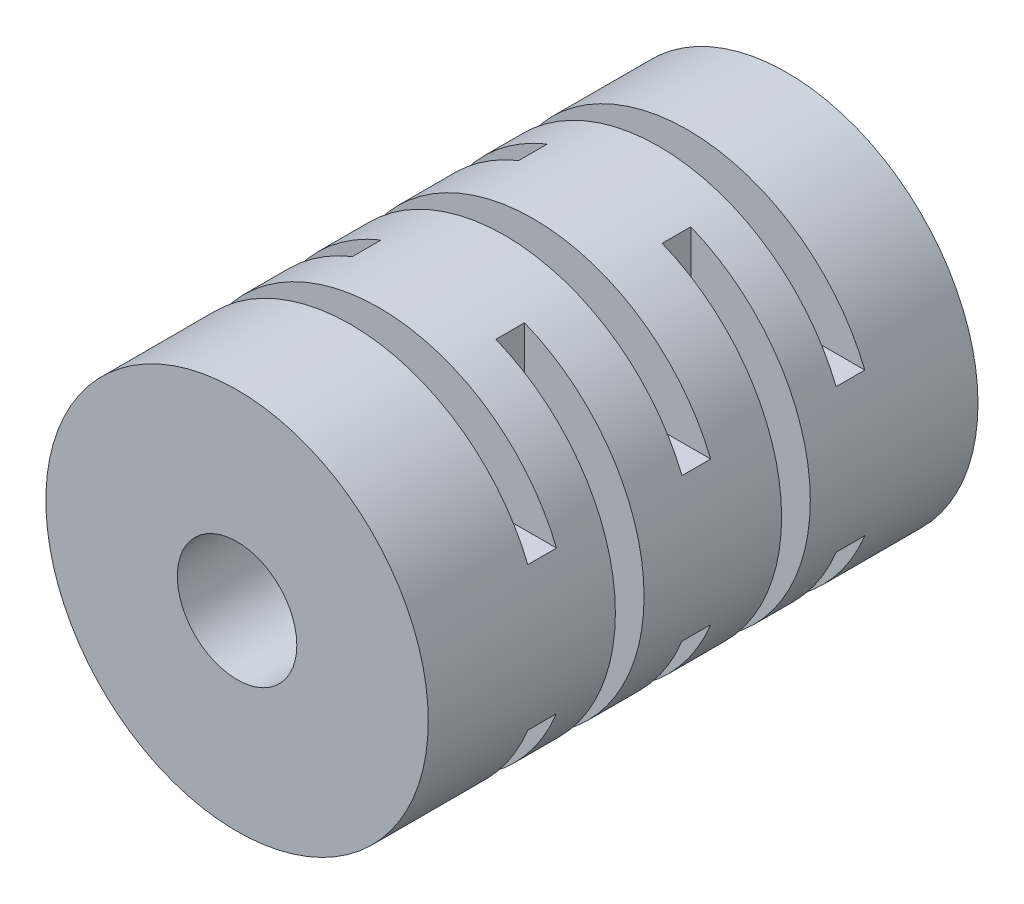
ISO-10303-21;
HEADER;
FILE_DESCRIPTION(('STEP AP214'),'2;1');
FILE_NAME('part.step','',(''),(''),'','','');
FILE_SCHEMA(('AUTOMOTIVE_DESIGN { 1 0 10303 214 1 1 1 1 }'));
ENDSEC;
DATA;
#1=APPLICATION_CONTEXT('core data for automotive mechanical design processes');
#2=APPLICATION_PROTOCOL_DEFINITION('international standard','automotive_design',2000,#1);
#3=PRODUCT_CONTEXT('',#1,'mechanical');
#4=PRODUCT('Part','Part','',(#3));
#5=PRODUCT_RELATED_PRODUCT_CATEGORY('part','',(#4));
#6=PRODUCT_DEFINITION_FORMATION('','',#4);
#7=PRODUCT_DEFINITION_CONTEXT('part definition',#1,'design');
#8=PRODUCT_DEFINITION('design','',#6,#7);
#9=PRODUCT_DEFINITION_SHAPE('','',#8);
#10=(LENGTH_UNIT() NAMED_UNIT(*) SI_UNIT(.MILLI.,.METRE.));
#11=(NAMED_UNIT(*) PLANE_ANGLE_UNIT() SI_UNIT($,.RADIAN.));
#12=(NAMED_UNIT(*) SI_UNIT($,.STERADIAN.) SOLID_ANGLE_UNIT());
#13=UNCERTAINTY_MEASURE_WITH_UNIT(LENGTH_MEASURE(1.E-05),#10,'distance_accuracy_value','');
#14=(GEOMETRIC_REPRESENTATION_CONTEXT(3) GLOBAL_UNCERTAINTY_ASSIGNED_CONTEXT((#13)) GLOBAL_UNIT_ASSIGNED_CONTEXT((#10,
#11,#12)) REPRESENTATION_CONTEXT('',''));
#15=CARTESIAN_POINT('',(0.,0.,0.));
#16=DIRECTION('',(0.,0.,1.));
#17=DIRECTION('',(1.,0.,0.));
#18=AXIS2_PLACEMENT_3D('',#15,#16,#17);
#19=CARTESIAN_POINT('',(0.,0.,23.));
#20=DIRECTION('',(0.,0.,1.));
#21=DIRECTION('',(1.,0.,0.));
#22=AXIS2_PLACEMENT_3D('',#19,#20,#21);
#23=PLANE('',#22);
#24=CARTESIAN_POINT('',(0.,0.,23.));
#25=DIRECTION('',(0.,0.,1.));
#26=DIRECTION('',(1.,0.,0.));
#27=AXIS2_PLACEMENT_3D('',#24,#25,#26);
#28=CIRCLE('',#27,8.);
#29=CARTESIAN_POINT('',(8.,0.,23.));
#30=VERTEX_POINT('',#29);
#31=EDGE_CURVE('E292',#30,#30,#28,.T.);
#32=ORIENTED_EDGE('',*,*,#31,.T.);
#33=EDGE_LOOP('',(#32));
#34=FACE_BOUND('',#33,.T.);
#35=CARTESIAN_POINT('',(0.,0.,23.));
#36=DIRECTION('',(0.,0.,1.));
#37=DIRECTION('',(1.,0.,0.));
#38=AXIS2_PLACEMENT_3D('',#35,#36,#37);
#39=CIRCLE('',#38,2.5);
#40=CARTESIAN_POINT('',(2.5,0.,23.));
#41=VERTEX_POINT('',#40);
#42=EDGE_CURVE('E296',#41,#41,#39,.T.);
#43=ORIENTED_EDGE('',*,*,#42,.F.);
#44=EDGE_LOOP('',(#43));
#45=FACE_BOUND('',#44,.T.);
#46=ADVANCED_FACE('F32',(#34,#45),#23,.T.);
#47=CARTESIAN_POINT('',(0.,0.,0.));
#48=DIRECTION('',(0.,0.,1.));
#49=DIRECTION('',(1.,0.,0.));
#50=AXIS2_PLACEMENT_3D('',#47,#48,#49);
#51=PLANE('',#50);
#52=CARTESIAN_POINT('',(0.,0.,0.));
#53=DIRECTION('',(0.,0.,1.));
#54=DIRECTION('',(1.,0.,0.));
#55=AXIS2_PLACEMENT_3D('',#52,#53,#54);
#56=CIRCLE('',#55,8.);
#57=CARTESIAN_POINT('',(8.,0.,0.));
#58=VERTEX_POINT('',#57);
#59=EDGE_CURVE('E293',#58,#58,#56,.T.);
#60=ORIENTED_EDGE('',*,*,#59,.F.);
#61=EDGE_LOOP('',(#60));
#62=FACE_BOUND('',#61,.T.);
#63=CARTESIAN_POINT('',(0.,0.,0.));
#64=DIRECTION('',(0.,0.,1.));
#65=DIRECTION('',(1.,0.,0.));
#66=AXIS2_PLACEMENT_3D('',#63,#64,#65);
#67=CIRCLE('',#66,2.5);
#68=CARTESIAN_POINT('',(2.5,0.,0.));
#69=VERTEX_POINT('',#68);
#70=EDGE_CURVE('E299',#69,#69,#67,.T.);
#71=ORIENTED_EDGE('',*,*,#70,.T.);
#72=EDGE_LOOP('',(#71));
#73=FACE_BOUND('',#72,.T.);
#74=ADVANCED_FACE('F373',(#62,#73),#51,.F.);
#75=CARTESIAN_POINT('',(0.,0.,23.));
#76=DIRECTION('',(0.,0.,-1.));
#77=DIRECTION('',(-1.,0.,0.));
#78=AXIS2_PLACEMENT_3D('',#75,#76,#77);
#79=CYLINDRICAL_SURFACE('',#78,8.);
#80=CARTESIAN_POINT('',(0.,0.,5.35124700606681));
#81=DIRECTION('',(0.,0.,1.));
#82=DIRECTION('',(0.,-1.,0.));
#83=AXIS2_PLACEMENT_3D('',#80,#81,#82);
#84=CIRCLE('',#83,8.);
#85=CARTESIAN_POINT('',(-7.41619848709566,-3.,5.35124700606682));
#86=VERTEX_POINT('',#85);
#87=CARTESIAN_POINT('',(7.41619848709566,-3.,5.35124700606682));
#88=VERTEX_POINT('',#87);
#89=EDGE_CURVE('E40',#86,#88,#84,.T.);
#90=ORIENTED_EDGE('',*,*,#89,.T.);
#91=DIRECTION('',(0.,0.,-1.));
#92=VECTOR('',#91,1.);
#93=CARTESIAN_POINT('',(7.41619848709566,-3.,23.));
#94=LINE('',#93,#92);
#95=CARTESIAN_POINT('',(7.41619848709566,-3.,4.15124700606682));
#96=VERTEX_POINT('',#95);
#97=EDGE_CURVE('E11',#88,#96,#94,.T.);
#98=ORIENTED_EDGE('',*,*,#97,.T.);
#99=CARTESIAN_POINT('',(0.,0.,4.15124700606681));
#100=DIRECTION('',(0.,0.,-1.));
#101=DIRECTION('',(0.,1.,0.));
#102=AXIS2_PLACEMENT_3D('',#99,#100,#101);
#103=CIRCLE('',#102,8.);
#104=CARTESIAN_POINT('',(-7.41619848709566,-3.,4.15124700606682));
#105=VERTEX_POINT('',#104);
#106=EDGE_CURVE('E169',#96,#105,#103,.T.);
#107=ORIENTED_EDGE('',*,*,#106,.T.);
#108=DIRECTION('',(0.,0.,-1.));
#109=VECTOR('',#108,1.);
#110=CARTESIAN_POINT('',(-7.41619848709566,-3.,23.));
#111=LINE('',#110,#109);
#112=EDGE_CURVE('E175',#105,#86,#111,.F.);
#113=ORIENTED_EDGE('',*,*,#112,.T.);
#114=EDGE_LOOP('',(#90,#98,#107,#113));
#115=FACE_BOUND('',#114,.T.);
#116=CARTESIAN_POINT('',(0.,0.,18.2510441796467));
#117=DIRECTION('',(0.,0.,1.));
#118=DIRECTION('',(1.,0.,0.));
#119=AXIS2_PLACEMENT_3D('',#116,#117,#118);
#120=CIRCLE('',#119,8.);
#121=CARTESIAN_POINT('',(-7.41619848709566,-3.,18.2510441796467));
#122=VERTEX_POINT('',#121);
#123=CARTESIAN_POINT('',(7.41619848709566,-3.,18.2510441796467));
#124=VERTEX_POINT('',#123);
#125=EDGE_CURVE('E187',#122,#124,#120,.T.);
#126=ORIENTED_EDGE('',*,*,#125,.T.);
#127=DIRECTION('',(0.,0.,-1.));
#128=VECTOR('',#127,1.);
#129=CARTESIAN_POINT('',(7.41619848709566,-3.,23.));
#130=LINE('',#129,#128);
#131=CARTESIAN_POINT('',(7.41619848709566,-3.,17.0510441796467));
#132=VERTEX_POINT('',#131);
#133=EDGE_CURVE('E184',#124,#132,#130,.T.);
#134=ORIENTED_EDGE('',*,*,#133,.T.);
#135=CARTESIAN_POINT('',(0.,0.,17.0510441796467));
#136=DIRECTION('',(0.,0.,-1.));
#137=DIRECTION('',(-1.,0.,0.));
#138=AXIS2_PLACEMENT_3D('',#135,#136,#137);
#139=CIRCLE('',#138,8.);
#140=CARTESIAN_POINT('',(-7.41619848709566,-3.,17.0510441796467));
#141=VERTEX_POINT('',#140);
#142=EDGE_CURVE('E190',#132,#141,#139,.T.);
#143=ORIENTED_EDGE('',*,*,#142,.T.);
#144=DIRECTION('',(0.,0.,-1.));
#145=VECTOR('',#144,1.);
#146=CARTESIAN_POINT('',(-7.41619848709566,-3.,23.));
#147=LINE('',#146,#145);
#148=EDGE_CURVE('E193',#141,#122,#147,.F.);
#149=ORIENTED_EDGE('',*,*,#148,.T.);
#150=EDGE_LOOP('',(#126,#134,#143,#149));
#151=FACE_BOUND('',#150,.T.);
#152=CARTESIAN_POINT('',(0.,0.,11.8011455928567));
#153=DIRECTION('',(0.,0.,1.));
#154=DIRECTION('',(0.,-1.,0.));
#155=AXIS2_PLACEMENT_3D('',#152,#153,#154);
#156=CIRCLE('',#155,8.);
#157=CARTESIAN_POINT('',(-7.41619848709566,-3.,11.8011455928567));
#158=VERTEX_POINT('',#157);
#159=CARTESIAN_POINT('',(7.41619848709566,-3.,11.8011455928567));
#160=VERTEX_POINT('',#159);
#161=EDGE_CURVE('E199',#158,#160,#156,.T.);
#162=ORIENTED_EDGE('',*,*,#161,.T.);
#163=DIRECTION('',(0.,0.,-1.));
#164=VECTOR('',#163,1.);
#165=CARTESIAN_POINT('',(7.41619848709566,-3.,23.));
#166=LINE('',#165,#164);
#167=CARTESIAN_POINT('',(7.41619848709566,-3.,10.6011455928567));
#168=VERTEX_POINT('',#167);
#169=EDGE_CURVE('E196',#160,#168,#166,.T.);
#170=ORIENTED_EDGE('',*,*,#169,.T.);
#171=CARTESIAN_POINT('',(0.,0.,10.6011455928567));
#172=DIRECTION('',(0.,0.,-1.));
#173=DIRECTION('',(0.,1.,0.));
#174=AXIS2_PLACEMENT_3D('',#171,#172,#173);
#175=CIRCLE('',#174,8.);
#176=CARTESIAN_POINT('',(-7.41619848709566,-3.,10.6011455928567));
#177=VERTEX_POINT('',#176);
#178=EDGE_CURVE('E202',#168,#177,#175,.T.);
#179=ORIENTED_EDGE('',*,*,#178,.T.);
#180=DIRECTION('',(0.,0.,-1.));
#181=VECTOR('',#180,1.);
#182=CARTESIAN_POINT('',(-7.41619848709566,-3.,23.));
#183=LINE('',#182,#181);
#184=EDGE_CURVE('E205',#177,#158,#183,.F.);
#185=ORIENTED_EDGE('',*,*,#184,.T.);
#186=EDGE_LOOP('',(#162,#170,#179,#185));
#187=FACE_BOUND('',#186,.T.);
#188=CARTESIAN_POINT('',(0.,0.,5.35124700606681));
#189=DIRECTION('',(0.,0.,1.));
#190=DIRECTION('',(0.,-1.,0.));
#191=AXIS2_PLACEMENT_3D('',#188,#189,#190);
#192=CIRCLE('',#191,8.);
#193=CARTESIAN_POINT('',(7.41619848709566,3.,5.35124700606682));
#194=VERTEX_POINT('',#193);
#195=CARTESIAN_POINT('',(-7.41619848709566,3.,5.35124700606682));
#196=VERTEX_POINT('',#195);
#197=EDGE_CURVE('E211',#194,#196,#192,.T.);
#198=ORIENTED_EDGE('',*,*,#197,.T.);
#199=DIRECTION('',(0.,0.,-1.));
#200=VECTOR('',#199,1.);
#201=CARTESIAN_POINT('',(-7.41619848709566,3.,23.));
#202=LINE('',#201,#200);
#203=CARTESIAN_POINT('',(-7.41619848709566,3.,4.15124700606682));
#204=VERTEX_POINT('',#203);
#205=EDGE_CURVE('E208',#196,#204,#202,.T.);
#206=ORIENTED_EDGE('',*,*,#205,.T.);
#207=CARTESIAN_POINT('',(0.,0.,4.15124700606681));
#208=DIRECTION('',(0.,0.,-1.));
#209=DIRECTION('',(0.,1.,0.));
#210=AXIS2_PLACEMENT_3D('',#207,#208,#209);
#211=CIRCLE('',#210,8.);
#212=CARTESIAN_POINT('',(7.41619848709566,3.,4.15124700606682));
#213=VERTEX_POINT('',#212);
#214=EDGE_CURVE('E214',#204,#213,#211,.T.);
#215=ORIENTED_EDGE('',*,*,#214,.T.);
#216=DIRECTION('',(0.,0.,-1.));
#217=VECTOR('',#216,1.);
#218=CARTESIAN_POINT('',(7.41619848709566,3.,23.));
#219=LINE('',#218,#217);
#220=EDGE_CURVE('E217',#213,#194,#219,.F.);
#221=ORIENTED_EDGE('',*,*,#220,.T.);
#222=EDGE_LOOP('',(#198,#206,#215,#221));
#223=FACE_BOUND('',#222,.T.);
#224=CARTESIAN_POINT('',(0.,0.,18.2510441796467));
#225=DIRECTION('',(0.,0.,1.));
#226=DIRECTION('',(1.,0.,0.));
#227=AXIS2_PLACEMENT_3D('',#224,#225,#226);
#228=CIRCLE('',#227,8.);
#229=CARTESIAN_POINT('',(7.41619848709566,3.,18.2510441796467));
#230=VERTEX_POINT('',#229);
#231=CARTESIAN_POINT('',(-7.41619848709566,3.,18.2510441796467));
#232=VERTEX_POINT('',#231);
#233=EDGE_CURVE('E223',#230,#232,#228,.T.);
#234=ORIENTED_EDGE('',*,*,#233,.T.);
#235=DIRECTION('',(0.,0.,-1.));
#236=VECTOR('',#235,1.);
#237=CARTESIAN_POINT('',(-7.41619848709566,3.,23.));
#238=LINE('',#237,#236);
#239=CARTESIAN_POINT('',(-7.41619848709566,3.,17.0510441796467));
#240=VERTEX_POINT('',#239);
#241=EDGE_CURVE('E220',#232,#240,#238,.T.);
#242=ORIENTED_EDGE('',*,*,#241,.T.);
#243=CARTESIAN_POINT('',(0.,0.,17.0510441796467));
#244=DIRECTION('',(0.,0.,-1.));
#245=DIRECTION('',(-1.,0.,0.));
#246=AXIS2_PLACEMENT_3D('',#243,#244,#245);
#247=CIRCLE('',#246,8.);
#248=CARTESIAN_POINT('',(7.41619848709566,3.,17.0510441796467));
#249=VERTEX_POINT('',#248);
#250=EDGE_CURVE('E226',#240,#249,#247,.T.);
#251=ORIENTED_EDGE('',*,*,#250,.T.);
#252=DIRECTION('',(0.,0.,-1.));
#253=VECTOR('',#252,1.);
#254=CARTESIAN_POINT('',(7.41619848709566,3.,23.));
#255=LINE('',#254,#253);
#256=EDGE_CURVE('E229',#249,#230,#255,.F.);
#257=ORIENTED_EDGE('',*,*,#256,.T.);
#258=EDGE_LOOP('',(#234,#242,#251,#257));
#259=FACE_BOUND('',#258,.T.);
#260=CARTESIAN_POINT('',(0.,0.,11.8011455928567));
#261=DIRECTION('',(0.,0.,1.));
#262=DIRECTION('',(0.,-1.,0.));
#263=AXIS2_PLACEMENT_3D('',#260,#261,#262);
#264=CIRCLE('',#263,8.);
#265=CARTESIAN_POINT('',(7.41619848709566,3.,11.8011455928567));
#266=VERTEX_POINT('',#265);
#267=CARTESIAN_POINT('',(-7.41619848709566,3.,11.8011455928567));
#268=VERTEX_POINT('',#267);
#269=EDGE_CURVE('E235',#266,#268,#264,.T.);
#270=ORIENTED_EDGE('',*,*,#269,.T.);
#271=DIRECTION('',(0.,0.,-1.));
#272=VECTOR('',#271,1.);
#273=CARTESIAN_POINT('',(-7.41619848709566,3.,23.));
#274=LINE('',#273,#272);
#275=CARTESIAN_POINT('',(-7.41619848709566,3.,10.6011455928567));
#276=VERTEX_POINT('',#275);
#277=EDGE_CURVE('E232',#268,#276,#274,.T.);
#278=ORIENTED_EDGE('',*,*,#277,.T.);
#279=CARTESIAN_POINT('',(0.,0.,10.6011455928567));
#280=DIRECTION('',(0.,0.,-1.));
#281=DIRECTION('',(0.,1.,0.));
#282=AXIS2_PLACEMENT_3D('',#279,#280,#281);
#283=CIRCLE('',#282,8.);
#284=CARTESIAN_POINT('',(7.41619848709566,3.,10.6011455928567));
#285=VERTEX_POINT('',#284);
#286=EDGE_CURVE('E238',#276,#285,#283,.T.);
#287=ORIENTED_EDGE('',*,*,#286,.T.);
#288=DIRECTION('',(0.,0.,-1.));
#289=VECTOR('',#288,1.);
#290=CARTESIAN_POINT('',(7.41619848709566,3.,23.));
#291=LINE('',#290,#289);
#292=EDGE_CURVE('E241',#285,#266,#291,.F.);
#293=ORIENTED_EDGE('',*,*,#292,.T.);
#294=EDGE_LOOP('',(#270,#278,#287,#293));
#295=FACE_BOUND('',#294,.T.);
#296=DIRECTION('',(0.,0.,-1.));
#297=VECTOR('',#296,1.);
#298=CARTESIAN_POINT('',(2.99999999999999,7.41619848709566,23.));
#299=LINE('',#298,#297);
#300=CARTESIAN_POINT('',(3.,7.41619848709566,15.1712151670788));
#301=VERTEX_POINT('',#300);
#302=CARTESIAN_POINT('',(3.,7.41619848709566,13.9712151670788));
#303=VERTEX_POINT('',#302);
#304=EDGE_CURVE('E247',#301,#303,#299,.T.);
#305=ORIENTED_EDGE('',*,*,#304,.T.);
#306=CARTESIAN_POINT('',(0.,0.,13.9712151670788));
#307=DIRECTION('',(0.,0.,-1.));
#308=DIRECTION('',(-1.,0.,0.));
#309=AXIS2_PLACEMENT_3D('',#306,#307,#308);
#310=CIRCLE('',#309,8.);
#311=CARTESIAN_POINT('',(3.,-7.41619848709566,13.9712151670788));
#312=VERTEX_POINT('',#311);
#313=EDGE_CURVE('E244',#303,#312,#310,.T.);
#314=ORIENTED_EDGE('',*,*,#313,.T.);
#315=DIRECTION('',(0.,0.,-1.));
#316=VECTOR('',#315,1.);
#317=CARTESIAN_POINT('',(2.99999999999999,-7.41619848709566,23.));
#318=LINE('',#317,#316);
#319=CARTESIAN_POINT('',(3.,-7.41619848709566,15.1712151670788));
#320=VERTEX_POINT('',#319);
#321=EDGE_CURVE('E250',#312,#320,#318,.F.);
#322=ORIENTED_EDGE('',*,*,#321,.T.);
#323=CARTESIAN_POINT('',(0.,0.,15.1712151670788));
#324=DIRECTION('',(0.,0.,1.));
#325=DIRECTION('',(1.,0.,0.));
#326=AXIS2_PLACEMENT_3D('',#323,#324,#325);
#327=CIRCLE('',#326,8.);
#328=EDGE_CURVE('E253',#320,#301,#327,.T.);
#329=ORIENTED_EDGE('',*,*,#328,.T.);
#330=EDGE_LOOP('',(#305,#314,#322,#329));
#331=FACE_BOUND('',#330,.T.);
#332=DIRECTION('',(0.,0.,-1.));
#333=VECTOR('',#332,1.);
#334=CARTESIAN_POINT('',(3.,7.41619848709566,23.));
#335=LINE('',#334,#333);
#336=CARTESIAN_POINT('',(3.,7.41619848709566,8.21672267382401));
#337=VERTEX_POINT('',#336);
#338=CARTESIAN_POINT('',(3.,7.41619848709566,7.01672267382401));
#339=VERTEX_POINT('',#338);
#340=EDGE_CURVE('E259',#337,#339,#335,.T.);
#341=ORIENTED_EDGE('',*,*,#340,.T.);
#342=CARTESIAN_POINT('',(0.,0.,7.01672267382401));
#343=DIRECTION('',(0.,0.,-1.));
#344=DIRECTION('',(-1.,0.,0.));
#345=AXIS2_PLACEMENT_3D('',#342,#343,#344);
#346=CIRCLE('',#345,8.);
#347=CARTESIAN_POINT('',(3.,-7.41619848709566,7.01672267382401));
#348=VERTEX_POINT('',#347);
#349=EDGE_CURVE('E256',#339,#348,#346,.T.);
#350=ORIENTED_EDGE('',*,*,#349,.T.);
#351=DIRECTION('',(0.,0.,-1.));
#352=VECTOR('',#351,1.);
#353=CARTESIAN_POINT('',(3.,-7.41619848709566,23.));
#354=LINE('',#353,#352);
#355=CARTESIAN_POINT('',(3.,-7.41619848709566,8.21672267382401));
#356=VERTEX_POINT('',#355);
#357=EDGE_CURVE('E262',#348,#356,#354,.F.);
#358=ORIENTED_EDGE('',*,*,#357,.T.);
#359=CARTESIAN_POINT('',(0.,0.,8.21672267382401));
#360=DIRECTION('',(0.,0.,1.));
#361=DIRECTION('',(1.,0.,0.));
#362=AXIS2_PLACEMENT_3D('',#359,#360,#361);
#363=CIRCLE('',#362,8.);
#364=EDGE_CURVE('E265',#356,#337,#363,.T.);
#365=ORIENTED_EDGE('',*,*,#364,.T.);
#366=EDGE_LOOP('',(#341,#350,#358,#365));
#367=FACE_BOUND('',#366,.T.);
#368=DIRECTION('',(0.,0.,-1.));
#369=VECTOR('',#368,1.);
#370=CARTESIAN_POINT('',(-2.99999999999999,-7.41619848709566,23.));
#371=LINE('',#370,#369);
#372=CARTESIAN_POINT('',(-3.,-7.41619848709566,15.1712151670788));
#373=VERTEX_POINT('',#372);
#374=CARTESIAN_POINT('',(-3.,-7.41619848709566,13.9712151670788));
#375=VERTEX_POINT('',#374);
#376=EDGE_CURVE('E271',#373,#375,#371,.T.);
#377=ORIENTED_EDGE('',*,*,#376,.T.);
#378=CARTESIAN_POINT('',(0.,0.,13.9712151670788));
#379=DIRECTION('',(0.,0.,-1.));
#380=DIRECTION('',(-1.,0.,0.));
#381=AXIS2_PLACEMENT_3D('',#378,#379,#380);
#382=CIRCLE('',#381,8.);
#383=CARTESIAN_POINT('',(-3.,7.41619848709566,13.9712151670788));
#384=VERTEX_POINT('',#383);
#385=EDGE_CURVE('E268',#375,#384,#382,.T.);
#386=ORIENTED_EDGE('',*,*,#385,.T.);
#387=DIRECTION('',(0.,0.,-1.));
#388=VECTOR('',#387,1.);
#389=CARTESIAN_POINT('',(-2.99999999999999,7.41619848709566,23.));
#390=LINE('',#389,#388);
#391=CARTESIAN_POINT('',(-3.,7.41619848709566,15.1712151670788));
#392=VERTEX_POINT('',#391);
#393=EDGE_CURVE('E274',#384,#392,#390,.F.);
#394=ORIENTED_EDGE('',*,*,#393,.T.);
#395=CARTESIAN_POINT('',(0.,0.,15.1712151670788));
#396=DIRECTION('',(0.,0.,1.));
#397=DIRECTION('',(1.,0.,0.));
#398=AXIS2_PLACEMENT_3D('',#395,#396,#397);
#399=CIRCLE('',#398,8.);
#400=EDGE_CURVE('E277',#392,#373,#399,.T.);
#401=ORIENTED_EDGE('',*,*,#400,.T.);
#402=EDGE_LOOP('',(#377,#386,#394,#401));
#403=FACE_BOUND('',#402,.T.);
#404=DIRECTION('',(0.,0.,-1.));
#405=VECTOR('',#404,1.);
#406=CARTESIAN_POINT('',(-3.,-7.41619848709566,23.));
#407=LINE('',#406,#405);
#408=CARTESIAN_POINT('',(-3.,-7.41619848709566,8.21672267382401));
#409=VERTEX_POINT('',#408);
#410=CARTESIAN_POINT('',(-3.,-7.41619848709566,7.01672267382401));
#411=VERTEX_POINT('',#410);
#412=EDGE_CURVE('E283',#409,#411,#407,.T.);
#413=ORIENTED_EDGE('',*,*,#412,.T.);
#414=CARTESIAN_POINT('',(0.,0.,7.01672267382401));
#415=DIRECTION('',(0.,0.,-1.));
#416=DIRECTION('',(-1.,0.,0.));
#417=AXIS2_PLACEMENT_3D('',#414,#415,#416);
#418=CIRCLE('',#417,8.);
#419=CARTESIAN_POINT('',(-3.,7.41619848709566,7.01672267382401));
#420=VERTEX_POINT('',#419);
#421=EDGE_CURVE('E280',#411,#420,#418,.T.);
#422=ORIENTED_EDGE('',*,*,#421,.T.);
#423=DIRECTION('',(0.,0.,-1.));
#424=VECTOR('',#423,1.);
#425=CARTESIAN_POINT('',(-3.,7.41619848709566,23.));
#426=LINE('',#425,#424);
#427=CARTESIAN_POINT('',(-3.,7.41619848709566,8.21672267382401));
#428=VERTEX_POINT('',#427);
#429=EDGE_CURVE('E286',#420,#428,#426,.F.);
#430=ORIENTED_EDGE('',*,*,#429,.T.);
#431=CARTESIAN_POINT('',(0.,0.,8.21672267382401));
#432=DIRECTION('',(0.,0.,1.));
#433=DIRECTION('',(1.,0.,0.));
#434=AXIS2_PLACEMENT_3D('',#431,#432,#433);
#435=CIRCLE('',#434,8.);
#436=EDGE_CURVE('E289',#428,#409,#435,.T.);
#437=ORIENTED_EDGE('',*,*,#436,.T.);
#438=EDGE_LOOP('',(#413,#422,#430,#437));
#439=FACE_BOUND('',#438,.T.);
#440=ORIENTED_EDGE('',*,*,#31,.F.);
#441=EDGE_LOOP('',(#440));
#442=FACE_BOUND('',#441,.T.);
#443=ORIENTED_EDGE('',*,*,#59,.T.);
#444=EDGE_LOOP('',(#443));
#445=FACE_BOUND('',#444,.T.);
#446=ADVANCED_FACE('F34',(#115,#151,#187,#223,#259,#295,#331,#367,#403,#439,#442,#445),#79,.T.);
#447=CARTESIAN_POINT('',(0.,0.,23.));
#448=DIRECTION('',(0.,0.,-1.));
#449=DIRECTION('',(-1.,0.,0.));
#450=AXIS2_PLACEMENT_3D('',#447,#448,#449);
#451=CYLINDRICAL_SURFACE('',#450,2.5);
#452=ORIENTED_EDGE('',*,*,#42,.T.);
#453=EDGE_LOOP('',(#452));
#454=FACE_BOUND('',#453,.T.);
#455=ORIENTED_EDGE('',*,*,#70,.F.);
#456=EDGE_LOOP('',(#455));
#457=FACE_BOUND('',#456,.T.);
#458=ADVANCED_FACE('F382',(#454,#457),#451,.F.);
#459=CARTESIAN_POINT('',(-15.1369016074898,-8.,7.01672267382401));
#460=DIRECTION('',(0.,0.,-1.));
#461=DIRECTION('',(-1.,0.,0.));
#462=AXIS2_PLACEMENT_3D('',#459,#460,#461);
#463=PLANE('',#462);
#464=DIRECTION('',(0.,1.,0.));
#465=VECTOR('',#464,1.);
#466=CARTESIAN_POINT('',(-3.,-8.,7.01672267382401));
#467=LINE('',#466,#465);
#468=EDGE_CURVE('E302',#411,#420,#467,.T.);
#469=ORIENTED_EDGE('',*,*,#468,.T.);
#470=ORIENTED_EDGE('',*,*,#421,.F.);
#471=EDGE_LOOP('',(#469,#470));
#472=FACE_BOUND('',#471,.T.);
#473=ADVANCED_FACE('F385',(#472),#463,.F.);
#474=CARTESIAN_POINT('',(-3.,-8.,7.01672267382401));
#475=DIRECTION('',(1.,0.,0.));
#476=DIRECTION('',(0.,0.,-1.));
#477=AXIS2_PLACEMENT_3D('',#474,#475,#476);
#478=PLANE('',#477);
#479=DIRECTION('',(0.,1.,0.));
#480=VECTOR('',#479,1.);
#481=CARTESIAN_POINT('',(-3.,-8.,8.21672267382401));
#482=LINE('',#481,#480);
#483=EDGE_CURVE('E305',#409,#428,#482,.T.);
#484=ORIENTED_EDGE('',*,*,#483,.T.);
#485=ORIENTED_EDGE('',*,*,#429,.F.);
#486=ORIENTED_EDGE('',*,*,#468,.F.);
#487=ORIENTED_EDGE('',*,*,#412,.F.);
#488=EDGE_LOOP('',(#484,#485,#486,#487));
#489=FACE_BOUND('',#488,.T.);
#490=ADVANCED_FACE('F391',(#489),#478,.F.);
#491=CARTESIAN_POINT('',(-15.1369016074898,-8.,8.21672267382401));
#492=DIRECTION('',(0.,0.,1.));
#493=DIRECTION('',(1.,0.,0.));
#494=AXIS2_PLACEMENT_3D('',#491,#492,#493);
#495=PLANE('',#494);
#496=ORIENTED_EDGE('',*,*,#483,.F.);
#497=ORIENTED_EDGE('',*,*,#436,.F.);
#498=EDGE_LOOP('',(#496,#497));
#499=FACE_BOUND('',#498,.T.);
#500=ADVANCED_FACE('F387',(#499),#495,.F.);
#501=CARTESIAN_POINT('',(-14.7546369899311,-8.,13.9712151670788));
#502=DIRECTION('',(0.,0.,-1.));
#503=DIRECTION('',(-1.,0.,0.));
#504=AXIS2_PLACEMENT_3D('',#501,#502,#503);
#505=PLANE('',#504);
#506=DIRECTION('',(0.,1.,0.));
#507=VECTOR('',#506,1.);
#508=CARTESIAN_POINT('',(-3.,-8.,13.9712151670788));
#509=LINE('',#508,#507);
#510=EDGE_CURVE('E308',#375,#384,#509,.T.);
#511=ORIENTED_EDGE('',*,*,#510,.T.);
#512=ORIENTED_EDGE('',*,*,#385,.F.);
#513=EDGE_LOOP('',(#511,#512));
#514=FACE_BOUND('',#513,.T.);
#515=ADVANCED_FACE('F390',(#514),#505,.F.);
#516=CARTESIAN_POINT('',(-3.,-8.,13.9712151670788));
#517=DIRECTION('',(1.,0.,0.));
#518=DIRECTION('',(0.,0.,-1.));
#519=AXIS2_PLACEMENT_3D('',#516,#517,#518);
#520=PLANE('',#519);
#521=DIRECTION('',(0.,1.,0.));
#522=VECTOR('',#521,1.);
#523=CARTESIAN_POINT('',(-3.,-8.,15.1712151670788));
#524=LINE('',#523,#522);
#525=EDGE_CURVE('E311',#373,#392,#524,.T.);
#526=ORIENTED_EDGE('',*,*,#525,.T.);
#527=ORIENTED_EDGE('',*,*,#393,.F.);
#528=ORIENTED_EDGE('',*,*,#510,.F.);
#529=ORIENTED_EDGE('',*,*,#376,.F.);
#530=EDGE_LOOP('',(#526,#527,#528,#529));
#531=FACE_BOUND('',#530,.T.);
#532=ADVANCED_FACE('F403',(#531),#520,.F.);
#533=CARTESIAN_POINT('',(-14.7546369899311,-8.,15.1712151670788));
#534=DIRECTION('',(0.,0.,1.));
#535=DIRECTION('',(1.,0.,0.));
#536=AXIS2_PLACEMENT_3D('',#533,#534,#535);
#537=PLANE('',#536);
#538=ORIENTED_EDGE('',*,*,#525,.F.);
#539=ORIENTED_EDGE('',*,*,#400,.F.);
#540=EDGE_LOOP('',(#538,#539));
#541=FACE_BOUND('',#540,.T.);
#542=ADVANCED_FACE('F399',(#541),#537,.F.);
#543=CARTESIAN_POINT('',(15.1369016074898,8.,7.01672267382401));
#544=DIRECTION('',(0.,0.,-1.));
#545=DIRECTION('',(-1.,0.,0.));
#546=AXIS2_PLACEMENT_3D('',#543,#544,#545);
#547=PLANE('',#546);
#548=DIRECTION('',(0.,-1.,0.));
#549=VECTOR('',#548,1.);
#550=CARTESIAN_POINT('',(3.,8.,7.01672267382401));
#551=LINE('',#550,#549);
#552=EDGE_CURVE('E314',#339,#348,#551,.T.);
#553=ORIENTED_EDGE('',*,*,#552,.T.);
#554=ORIENTED_EDGE('',*,*,#349,.F.);
#555=EDGE_LOOP('',(#553,#554));
#556=FACE_BOUND('',#555,.T.);
#557=ADVANCED_FACE('F402',(#556),#547,.F.);
#558=CARTESIAN_POINT('',(3.,8.,7.01672267382401));
#559=DIRECTION('',(-1.,0.,0.));
#560=DIRECTION('',(0.,0.,1.));
#561=AXIS2_PLACEMENT_3D('',#558,#559,#560);
#562=PLANE('',#561);
#563=DIRECTION('',(0.,-1.,0.));
#564=VECTOR('',#563,1.);
#565=CARTESIAN_POINT('',(3.,8.,8.21672267382401));
#566=LINE('',#565,#564);
#567=EDGE_CURVE('E317',#337,#356,#566,.T.);
#568=ORIENTED_EDGE('',*,*,#567,.T.);
#569=ORIENTED_EDGE('',*,*,#357,.F.);
#570=ORIENTED_EDGE('',*,*,#552,.F.);
#571=ORIENTED_EDGE('',*,*,#340,.F.);
#572=EDGE_LOOP('',(#568,#569,#570,#571));
#573=FACE_BOUND('',#572,.T.);
#574=ADVANCED_FACE('F415',(#573),#562,.F.);
#575=CARTESIAN_POINT('',(15.1369016074898,8.,8.21672267382401));
#576=DIRECTION('',(0.,0.,1.));
#577=DIRECTION('',(1.,0.,0.));
#578=AXIS2_PLACEMENT_3D('',#575,#576,#577);
#579=PLANE('',#578);
#580=ORIENTED_EDGE('',*,*,#567,.F.);
#581=ORIENTED_EDGE('',*,*,#364,.F.);
#582=EDGE_LOOP('',(#580,#581));
#583=FACE_BOUND('',#582,.T.);
#584=ADVANCED_FACE('F411',(#583),#579,.F.);
#585=CARTESIAN_POINT('',(14.7546369899311,8.,13.9712151670788));
#586=DIRECTION('',(0.,0.,-1.));
#587=DIRECTION('',(-1.,0.,0.));
#588=AXIS2_PLACEMENT_3D('',#585,#586,#587);
#589=PLANE('',#588);
#590=DIRECTION('',(0.,-1.,0.));
#591=VECTOR('',#590,1.);
#592=CARTESIAN_POINT('',(3.,8.,13.9712151670788));
#593=LINE('',#592,#591);
#594=EDGE_CURVE('E320',#303,#312,#593,.T.);
#595=ORIENTED_EDGE('',*,*,#594,.T.);
#596=ORIENTED_EDGE('',*,*,#313,.F.);
#597=EDGE_LOOP('',(#595,#596));
#598=FACE_BOUND('',#597,.T.);
#599=ADVANCED_FACE('F414',(#598),#589,.F.);
#600=CARTESIAN_POINT('',(3.,8.,13.9712151670788));
#601=DIRECTION('',(-1.,0.,0.));
#602=DIRECTION('',(0.,0.,1.));
#603=AXIS2_PLACEMENT_3D('',#600,#601,#602);
#604=PLANE('',#603);
#605=DIRECTION('',(0.,-1.,0.));
#606=VECTOR('',#605,1.);
#607=CARTESIAN_POINT('',(3.,8.,15.1712151670788));
#608=LINE('',#607,#606);
#609=EDGE_CURVE('E323',#301,#320,#608,.T.);
#610=ORIENTED_EDGE('',*,*,#609,.T.);
#611=ORIENTED_EDGE('',*,*,#321,.F.);
#612=ORIENTED_EDGE('',*,*,#594,.F.);
#613=ORIENTED_EDGE('',*,*,#304,.F.);
#614=EDGE_LOOP('',(#610,#611,#612,#613));
#615=FACE_BOUND('',#614,.T.);
#616=ADVANCED_FACE('F427',(#615),#604,.F.);
#617=CARTESIAN_POINT('',(14.7546369899311,8.,15.1712151670788));
#618=DIRECTION('',(0.,0.,1.));
#619=DIRECTION('',(1.,0.,0.));
#620=AXIS2_PLACEMENT_3D('',#617,#618,#619);
#621=PLANE('',#620);
#622=ORIENTED_EDGE('',*,*,#609,.F.);
#623=ORIENTED_EDGE('',*,*,#328,.F.);
#624=EDGE_LOOP('',(#622,#623));
#625=FACE_BOUND('',#624,.T.);
#626=ADVANCED_FACE('F423',(#625),#621,.F.);
#627=CARTESIAN_POINT('',(-8.,11.3692783692784,11.8011455928567));
#628=DIRECTION('',(0.,0.,1.));
#629=DIRECTION('',(0.,-1.,0.));
#630=AXIS2_PLACEMENT_3D('',#627,#628,#629);
#631=PLANE('',#630);
#632=DIRECTION('',(1.,0.,0.));
#633=VECTOR('',#632,1.);
#634=CARTESIAN_POINT('',(-8.,3.,11.8011455928567));
#635=LINE('',#634,#633);
#636=EDGE_CURVE('E329',#268,#266,#635,.T.);
#637=ORIENTED_EDGE('',*,*,#636,.F.);
#638=ORIENTED_EDGE('',*,*,#269,.F.);
#639=EDGE_LOOP('',(#637,#638));
#640=FACE_BOUND('',#639,.T.);
#641=ADVANCED_FACE('F426',(#640),#631,.F.);
#642=CARTESIAN_POINT('',(-8.,11.3692783692784,10.6011455928567));
#643=DIRECTION('',(0.,0.,-1.));
#644=DIRECTION('',(0.,1.,0.));
#645=AXIS2_PLACEMENT_3D('',#642,#643,#644);
#646=PLANE('',#645);
#647=DIRECTION('',(1.,0.,0.));
#648=VECTOR('',#647,1.);
#649=CARTESIAN_POINT('',(-8.,3.,10.6011455928567));
#650=LINE('',#649,#648);
#651=EDGE_CURVE('E326',#276,#285,#650,.T.);
#652=ORIENTED_EDGE('',*,*,#651,.T.);
#653=ORIENTED_EDGE('',*,*,#286,.F.);
#654=EDGE_LOOP('',(#652,#653));
#655=FACE_BOUND('',#654,.T.);
#656=ADVANCED_FACE('F437',(#655),#646,.F.);
#657=CARTESIAN_POINT('',(-8.,3.,11.8011455928567));
#658=DIRECTION('',(0.,-1.,0.));
#659=DIRECTION('',(0.,0.,-1.));
#660=AXIS2_PLACEMENT_3D('',#657,#658,#659);
#661=PLANE('',#660);
#662=ORIENTED_EDGE('',*,*,#636,.T.);
#663=ORIENTED_EDGE('',*,*,#292,.F.);
#664=ORIENTED_EDGE('',*,*,#651,.F.);
#665=ORIENTED_EDGE('',*,*,#277,.F.);
#666=EDGE_LOOP('',(#662,#663,#664,#665));
#667=FACE_BOUND('',#666,.T.);
#668=ADVANCED_FACE('F439',(#667),#661,.F.);
#669=CARTESIAN_POINT('',(-8.,11.338508963509,18.2510441796467));
#670=DIRECTION('',(0.,0.,1.));
#671=DIRECTION('',(1.,0.,0.));
#672=AXIS2_PLACEMENT_3D('',#669,#670,#671);
#673=PLANE('',#672);
#674=DIRECTION('',(1.,0.,0.));
#675=VECTOR('',#674,1.);
#676=CARTESIAN_POINT('',(-8.,3.,18.2510441796467));
#677=LINE('',#676,#675);
#678=EDGE_CURVE('E334',#232,#230,#677,.T.);
#679=ORIENTED_EDGE('',*,*,#678,.F.);
#680=ORIENTED_EDGE('',*,*,#233,.F.);
#681=EDGE_LOOP('',(#679,#680));
#682=FACE_BOUND('',#681,.T.);
#683=ADVANCED_FACE('F442',(#682),#673,.F.);
#684=CARTESIAN_POINT('',(-8.,11.338508963509,17.0510441796467));
#685=DIRECTION('',(0.,0.,-1.));
#686=DIRECTION('',(-1.,0.,0.));
#687=AXIS2_PLACEMENT_3D('',#684,#685,#686);
#688=PLANE('',#687);
#689=DIRECTION('',(1.,0.,0.));
#690=VECTOR('',#689,1.);
#691=CARTESIAN_POINT('',(-8.,3.,17.0510441796467));
#692=LINE('',#691,#690);
#693=EDGE_CURVE('E331',#240,#249,#692,.T.);
#694=ORIENTED_EDGE('',*,*,#693,.T.);
#695=ORIENTED_EDGE('',*,*,#250,.F.);
#696=EDGE_LOOP('',(#694,#695));
#697=FACE_BOUND('',#696,.T.);
#698=ADVANCED_FACE('F449',(#697),#688,.F.);
#699=CARTESIAN_POINT('',(-8.,3.,18.2510441796467));
#700=DIRECTION('',(0.,-1.,0.));
#701=DIRECTION('',(0.,0.,-1.));
#702=AXIS2_PLACEMENT_3D('',#699,#700,#701);
#703=PLANE('',#702);
#704=ORIENTED_EDGE('',*,*,#678,.T.);
#705=ORIENTED_EDGE('',*,*,#256,.F.);
#706=ORIENTED_EDGE('',*,*,#693,.F.);
#707=ORIENTED_EDGE('',*,*,#241,.F.);
#708=EDGE_LOOP('',(#704,#705,#706,#707));
#709=FACE_BOUND('',#708,.T.);
#710=ADVANCED_FACE('F451',(#709),#703,.F.);
#711=CARTESIAN_POINT('',(-8.,10.9692760942761,5.35124700606682));
#712=DIRECTION('',(0.,0.,1.));
#713=DIRECTION('',(0.,-1.,0.));
#714=AXIS2_PLACEMENT_3D('',#711,#712,#713);
#715=PLANE('',#714);
#716=DIRECTION('',(1.,0.,0.));
#717=VECTOR('',#716,1.);
#718=CARTESIAN_POINT('',(-8.,3.,5.35124700606682));
#719=LINE('',#718,#717);
#720=EDGE_CURVE('E339',#196,#194,#719,.T.);
#721=ORIENTED_EDGE('',*,*,#720,.F.);
#722=ORIENTED_EDGE('',*,*,#197,.F.);
#723=EDGE_LOOP('',(#721,#722));
#724=FACE_BOUND('',#723,.T.);
#725=ADVANCED_FACE('F454',(#724),#715,.F.);
#726=CARTESIAN_POINT('',(-8.,10.9692760942761,4.15124700606682));
#727=DIRECTION('',(0.,0.,-1.));
#728=DIRECTION('',(0.,1.,0.));
#729=AXIS2_PLACEMENT_3D('',#726,#727,#728);
#730=PLANE('',#729);
#731=DIRECTION('',(1.,0.,0.));
#732=VECTOR('',#731,1.);
#733=CARTESIAN_POINT('',(-8.,3.,4.15124700606682));
#734=LINE('',#733,#732);
#735=EDGE_CURVE('E336',#204,#213,#734,.T.);
#736=ORIENTED_EDGE('',*,*,#735,.T.);
#737=ORIENTED_EDGE('',*,*,#214,.F.);
#738=EDGE_LOOP('',(#736,#737));
#739=FACE_BOUND('',#738,.T.);
#740=ADVANCED_FACE('F461',(#739),#730,.F.);
#741=CARTESIAN_POINT('',(-8.,3.,5.35124700606682));
#742=DIRECTION('',(0.,-1.,0.));
#743=DIRECTION('',(0.,0.,-1.));
#744=AXIS2_PLACEMENT_3D('',#741,#742,#743);
#745=PLANE('',#744);
#746=ORIENTED_EDGE('',*,*,#720,.T.);
#747=ORIENTED_EDGE('',*,*,#220,.F.);
#748=ORIENTED_EDGE('',*,*,#735,.F.);
#749=ORIENTED_EDGE('',*,*,#205,.F.);
#750=EDGE_LOOP('',(#746,#747,#748,#749));
#751=FACE_BOUND('',#750,.T.);
#752=ADVANCED_FACE('F463',(#751),#745,.F.);
#753=CARTESIAN_POINT('',(8.,-11.3692783692784,11.8011455928567));
#754=DIRECTION('',(0.,0.,1.));
#755=DIRECTION('',(0.,-1.,0.));
#756=AXIS2_PLACEMENT_3D('',#753,#754,#755);
#757=PLANE('',#756);
#758=DIRECTION('',(-1.,0.,0.));
#759=VECTOR('',#758,1.);
#760=CARTESIAN_POINT('',(8.,-3.,11.8011455928567));
#761=LINE('',#760,#759);
#762=EDGE_CURVE('E344',#160,#158,#761,.T.);
#763=ORIENTED_EDGE('',*,*,#762,.F.);
#764=ORIENTED_EDGE('',*,*,#161,.F.);
#765=EDGE_LOOP('',(#763,#764));
#766=FACE_BOUND('',#765,.T.);
#767=ADVANCED_FACE('F466',(#766),#757,.F.);
#768=CARTESIAN_POINT('',(8.,-11.3692783692784,10.6011455928567));
#769=DIRECTION('',(0.,0.,-1.));
#770=DIRECTION('',(0.,1.,0.));
#771=AXIS2_PLACEMENT_3D('',#768,#769,#770);
#772=PLANE('',#771);
#773=DIRECTION('',(-1.,0.,0.));
#774=VECTOR('',#773,1.);
#775=CARTESIAN_POINT('',(8.,-3.,10.6011455928567));
#776=LINE('',#775,#774);
#777=EDGE_CURVE('E341',#168,#177,#776,.T.);
#778=ORIENTED_EDGE('',*,*,#777,.T.);
#779=ORIENTED_EDGE('',*,*,#178,.F.);
#780=EDGE_LOOP('',(#778,#779));
#781=FACE_BOUND('',#780,.T.);
#782=ADVANCED_FACE('F367',(#781),#772,.F.);
#783=CARTESIAN_POINT('',(8.,-3.,11.8011455928567));
#784=DIRECTION('',(0.,1.,0.));
#785=DIRECTION('',(0.,0.,1.));
#786=AXIS2_PLACEMENT_3D('',#783,#784,#785);
#787=PLANE('',#786);
#788=ORIENTED_EDGE('',*,*,#762,.T.);
#789=ORIENTED_EDGE('',*,*,#184,.F.);
#790=ORIENTED_EDGE('',*,*,#777,.F.);
#791=ORIENTED_EDGE('',*,*,#169,.F.);
#792=EDGE_LOOP('',(#788,#789,#790,#791));
#793=FACE_BOUND('',#792,.T.);
#794=ADVANCED_FACE('F360',(#793),#787,.F.);
#795=CARTESIAN_POINT('',(8.,-11.338508963509,18.2510441796467));
#796=DIRECTION('',(0.,0.,1.));
#797=DIRECTION('',(1.,0.,0.));
#798=AXIS2_PLACEMENT_3D('',#795,#796,#797);
#799=PLANE('',#798);
#800=DIRECTION('',(-1.,0.,0.));
#801=VECTOR('',#800,1.);
#802=CARTESIAN_POINT('',(8.,-3.,18.2510441796467));
#803=LINE('',#802,#801);
#804=EDGE_CURVE('E55',#124,#122,#803,.T.);
#805=ORIENTED_EDGE('',*,*,#804,.F.);
#806=ORIENTED_EDGE('',*,*,#125,.F.);
#807=EDGE_LOOP('',(#805,#806));
#808=FACE_BOUND('',#807,.T.);
#809=ADVANCED_FACE('F358',(#808),#799,.F.);
#810=CARTESIAN_POINT('',(8.,-11.338508963509,17.0510441796467));
#811=DIRECTION('',(0.,0.,-1.));
#812=DIRECTION('',(-1.,0.,0.));
#813=AXIS2_PLACEMENT_3D('',#810,#811,#812);
#814=PLANE('',#813);
#815=DIRECTION('',(-1.,0.,0.));
#816=VECTOR('',#815,1.);
#817=CARTESIAN_POINT('',(8.,-3.,17.0510441796467));
#818=LINE('',#817,#816);
#819=EDGE_CURVE('E346',#132,#141,#818,.T.);
#820=ORIENTED_EDGE('',*,*,#819,.T.);
#821=ORIENTED_EDGE('',*,*,#142,.F.);
#822=EDGE_LOOP('',(#820,#821));
#823=FACE_BOUND('',#822,.T.);
#824=ADVANCED_FACE('F354',(#823),#814,.F.);
#825=CARTESIAN_POINT('',(8.,-3.,18.2510441796467));
#826=DIRECTION('',(0.,1.,0.));
#827=DIRECTION('',(0.,0.,1.));
#828=AXIS2_PLACEMENT_3D('',#825,#826,#827);
#829=PLANE('',#828);
#830=ORIENTED_EDGE('',*,*,#804,.T.);
#831=ORIENTED_EDGE('',*,*,#148,.F.);
#832=ORIENTED_EDGE('',*,*,#819,.F.);
#833=ORIENTED_EDGE('',*,*,#133,.F.);
#834=EDGE_LOOP('',(#830,#831,#832,#833));
#835=FACE_BOUND('',#834,.T.);
#836=ADVANCED_FACE('F356',(#835),#829,.F.);
#837=CARTESIAN_POINT('',(8.,-10.9692760942761,5.35124700606682));
#838=DIRECTION('',(0.,0.,1.));
#839=DIRECTION('',(0.,-1.,0.));
#840=AXIS2_PLACEMENT_3D('',#837,#838,#839);
#841=PLANE('',#840);
#842=DIRECTION('',(-1.,0.,0.));
#843=VECTOR('',#842,1.);
#844=CARTESIAN_POINT('',(8.,-3.,5.35124700606682));
#845=LINE('',#844,#843);
#846=EDGE_CURVE('E47',#88,#86,#845,.T.);
#847=ORIENTED_EDGE('',*,*,#846,.F.);
#848=ORIENTED_EDGE('',*,*,#89,.F.);
#849=EDGE_LOOP('',(#847,#848));
#850=FACE_BOUND('',#849,.T.);
#851=ADVANCED_FACE('F637',(#850),#841,.F.);
#852=CARTESIAN_POINT('',(8.,-10.9692760942761,4.15124700606682));
#853=DIRECTION('',(0.,0.,-1.));
#854=DIRECTION('',(0.,1.,0.));
#855=AXIS2_PLACEMENT_3D('',#852,#853,#854);
#856=PLANE('',#855);
#857=DIRECTION('',(-1.,0.,0.));
#858=VECTOR('',#857,1.);
#859=CARTESIAN_POINT('',(8.,-3.,4.15124700606682));
#860=LINE('',#859,#858);
#861=EDGE_CURVE('E172',#96,#105,#860,.T.);
#862=ORIENTED_EDGE('',*,*,#861,.T.);
#863=ORIENTED_EDGE('',*,*,#106,.F.);
#864=EDGE_LOOP('',(#862,#863));
#865=FACE_BOUND('',#864,.T.);
#866=ADVANCED_FACE('F171',(#865),#856,.F.);
#867=CARTESIAN_POINT('',(8.,-3.,5.35124700606682));
#868=DIRECTION('',(0.,1.,0.));
#869=DIRECTION('',(0.,0.,1.));
#870=AXIS2_PLACEMENT_3D('',#867,#868,#869);
#871=PLANE('',#870);
#872=ORIENTED_EDGE('',*,*,#846,.T.);
#873=ORIENTED_EDGE('',*,*,#112,.F.);
#874=ORIENTED_EDGE('',*,*,#861,.F.);
#875=ORIENTED_EDGE('',*,*,#97,.F.);
#876=EDGE_LOOP('',(#872,#873,#874,#875));
#877=FACE_BOUND('',#876,.T.);
#878=ADVANCED_FACE('F177',(#877),#871,.F.);
#879=CLOSED_SHELL('',(#46,#74,#446,#458,#473,#490,#500,#515,#532,#542,#557,#574,#584,#599,#616,
#626,#641,#656,#668,#683,#698,#710,#725,#740,#752,#767,#782,#794,#809,#824,#836,#851,#866,#878));
#880=MANIFOLD_SOLID_BREP('B2',#879);
#881=ADVANCED_BREP_SHAPE_REPRESENTATION('',(#18,#880),#14);
#882=SHAPE_DEFINITION_REPRESENTATION(#9,#881);
ENDSEC;
END-ISO-10303-21;
